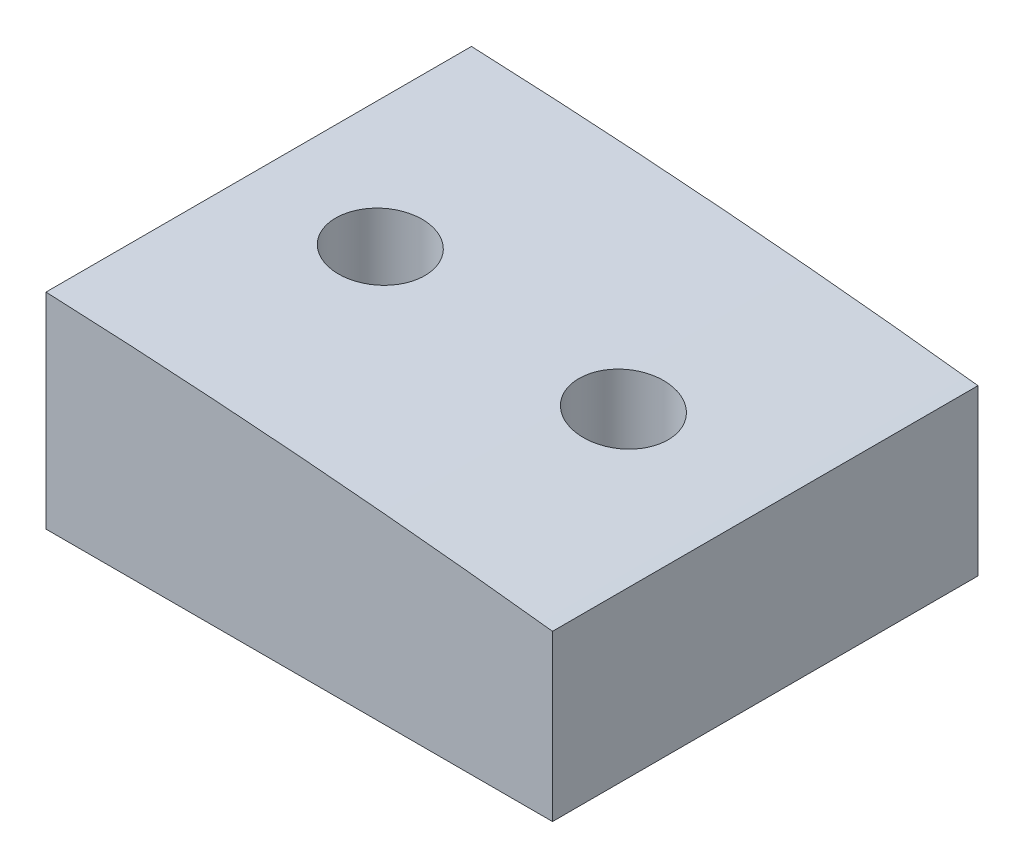
ISO-10303-21;
HEADER;
FILE_DESCRIPTION(('STEP AP214'),'2;1');
FILE_NAME('part.step','',(''),(''),'','','');
FILE_SCHEMA(('AUTOMOTIVE_DESIGN { 1 0 10303 214 1 1 1 1 }'));
ENDSEC;
DATA;
#1=APPLICATION_CONTEXT('core data for automotive mechanical design processes');
#2=APPLICATION_PROTOCOL_DEFINITION('international standard','automotive_design',2000,#1);
#3=PRODUCT_CONTEXT('',#1,'mechanical');
#4=PRODUCT('Part','Part','',(#3));
#5=PRODUCT_RELATED_PRODUCT_CATEGORY('part','',(#4));
#6=PRODUCT_DEFINITION_FORMATION('','',#4);
#7=PRODUCT_DEFINITION_CONTEXT('part definition',#1,'design');
#8=PRODUCT_DEFINITION('design','',#6,#7);
#9=PRODUCT_DEFINITION_SHAPE('','',#8);
#10=(LENGTH_UNIT() NAMED_UNIT(*) SI_UNIT(.MILLI.,.METRE.));
#11=(NAMED_UNIT(*) PLANE_ANGLE_UNIT() SI_UNIT($,.RADIAN.));
#12=(NAMED_UNIT(*) SI_UNIT($,.STERADIAN.) SOLID_ANGLE_UNIT());
#13=UNCERTAINTY_MEASURE_WITH_UNIT(LENGTH_MEASURE(1.E-05),#10,'distance_accuracy_value','');
#14=(GEOMETRIC_REPRESENTATION_CONTEXT(3) GLOBAL_UNCERTAINTY_ASSIGNED_CONTEXT((#13)) GLOBAL_UNIT_ASSIGNED_CONTEXT((#10,
#11,#12)) REPRESENTATION_CONTEXT('',''));
#15=CARTESIAN_POINT('',(0.,0.,0.));
#16=DIRECTION('',(0.,0.,1.));
#17=DIRECTION('',(1.,0.,0.));
#18=AXIS2_PLACEMENT_3D('',#15,#16,#17);
#19=CARTESIAN_POINT('',(0.,0.,15.75));
#20=DIRECTION('',(1.,0.,0.));
#21=DIRECTION('',(0.,0.,-1.));
#22=AXIS2_PLACEMENT_3D('',#19,#20,#21);
#23=PLANE('',#22);
#24=DIRECTION('',(0.,-1.,0.));
#25=VECTOR('',#24,1.);
#26=CARTESIAN_POINT('',(0.,0.,-15.75));
#27=LINE('',#26,#25);
#28=CARTESIAN_POINT('',(0.,15.2,-15.75));
#29=VERTEX_POINT('',#28);
#30=CARTESIAN_POINT('',(0.,0.,-15.75));
#31=VERTEX_POINT('',#30);
#32=EDGE_CURVE('E104',#29,#31,#27,.T.);
#33=ORIENTED_EDGE('',*,*,#32,.T.);
#34=DIRECTION('',(0.,0.,-1.));
#35=VECTOR('',#34,1.);
#36=CARTESIAN_POINT('',(0.,0.,15.75));
#37=LINE('',#36,#35);
#38=CARTESIAN_POINT('',(0.,0.,15.75));
#39=VERTEX_POINT('',#38);
#40=EDGE_CURVE('E11',#39,#31,#37,.T.);
#41=ORIENTED_EDGE('',*,*,#40,.F.);
#42=DIRECTION('',(0.,-1.,0.));
#43=VECTOR('',#42,1.);
#44=CARTESIAN_POINT('',(0.,0.,15.75));
#45=LINE('',#44,#43);
#46=CARTESIAN_POINT('',(0.,15.2,15.75));
#47=VERTEX_POINT('',#46);
#48=EDGE_CURVE('E91',#47,#39,#45,.T.);
#49=ORIENTED_EDGE('',*,*,#48,.F.);
#50=DIRECTION('',(0.,0.,-1.));
#51=VECTOR('',#50,1.);
#52=CARTESIAN_POINT('',(0.,15.2,15.75));
#53=LINE('',#52,#51);
#54=EDGE_CURVE('E100',#47,#29,#53,.T.);
#55=ORIENTED_EDGE('',*,*,#54,.T.);
#56=EDGE_LOOP('',(#33,#41,#49,#55));
#57=FACE_BOUND('',#56,.T.);
#58=ADVANCED_FACE('F34',(#57),#23,.F.);
#59=CARTESIAN_POINT('',(0.,0.,15.75));
#60=DIRECTION('',(0.,1.,0.));
#61=DIRECTION('',(0.,0.,1.));
#62=AXIS2_PLACEMENT_3D('',#59,#60,#61);
#63=PLANE('',#62);
#64=CARTESIAN_POINT('',(9.,0.,0.));
#65=DIRECTION('',(0.,-1.,0.));
#66=DIRECTION('',(0.,0.,-1.));
#67=AXIS2_PLACEMENT_3D('',#64,#65,#66);
#68=CIRCLE('',#67,3.29999999999999);
#69=CARTESIAN_POINT('',(9.,0.,-3.29999999999999));
#70=VERTEX_POINT('',#69);
#71=EDGE_CURVE('E152',#70,#70,#68,.T.);
#72=ORIENTED_EDGE('',*,*,#71,.F.);
#73=EDGE_LOOP('',(#72));
#74=FACE_BOUND('',#73,.T.);
#75=CARTESIAN_POINT('',(27.,0.,0.));
#76=DIRECTION('',(0.,-1.,0.));
#77=DIRECTION('',(0.,0.,-1.));
#78=AXIS2_PLACEMENT_3D('',#75,#76,#77);
#79=CIRCLE('',#78,3.29999999999999);
#80=CARTESIAN_POINT('',(27.,0.,-3.29999999999999));
#81=VERTEX_POINT('',#80);
#82=EDGE_CURVE('E116',#81,#81,#79,.T.);
#83=ORIENTED_EDGE('',*,*,#82,.F.);
#84=EDGE_LOOP('',(#83));
#85=FACE_BOUND('',#84,.T.);
#86=DIRECTION('',(1.,0.,0.));
#87=VECTOR('',#86,1.);
#88=CARTESIAN_POINT('',(0.,0.,-15.75));
#89=LINE('',#88,#87);
#90=CARTESIAN_POINT('',(37.5,0.,-15.75));
#91=VERTEX_POINT('',#90);
#92=EDGE_CURVE('E95',#31,#91,#89,.T.);
#93=ORIENTED_EDGE('',*,*,#92,.T.);
#94=DIRECTION('',(0.,0.,-1.));
#95=VECTOR('',#94,1.);
#96=CARTESIAN_POINT('',(37.5,0.,15.75));
#97=LINE('',#96,#95);
#98=CARTESIAN_POINT('',(37.5,0.,15.75));
#99=VERTEX_POINT('',#98);
#100=EDGE_CURVE('E47',#99,#91,#97,.T.);
#101=ORIENTED_EDGE('',*,*,#100,.F.);
#102=DIRECTION('',(1.,0.,0.));
#103=VECTOR('',#102,1.);
#104=CARTESIAN_POINT('',(0.,0.,15.75));
#105=LINE('',#104,#103);
#106=EDGE_CURVE('E86',#39,#99,#105,.T.);
#107=ORIENTED_EDGE('',*,*,#106,.F.);
#108=ORIENTED_EDGE('',*,*,#40,.T.);
#109=EDGE_LOOP('',(#93,#101,#107,#108));
#110=FACE_BOUND('',#109,.T.);
#111=ADVANCED_FACE('F94',(#74,#85,#110),#63,.F.);
#112=CARTESIAN_POINT('',(37.5,0.,15.75));
#113=DIRECTION('',(-1.,0.,0.));
#114=DIRECTION('',(0.,0.,1.));
#115=AXIS2_PLACEMENT_3D('',#112,#113,#114);
#116=PLANE('',#115);
#117=DIRECTION('',(0.,1.,0.));
#118=VECTOR('',#117,1.);
#119=CARTESIAN_POINT('',(37.5,0.,-15.75));
#120=LINE('',#119,#118);
#121=CARTESIAN_POINT('',(37.5,12.2,-15.75));
#122=VERTEX_POINT('',#121);
#123=EDGE_CURVE('E73',#91,#122,#120,.T.);
#124=ORIENTED_EDGE('',*,*,#123,.T.);
#125=DIRECTION('',(0.,0.,-1.));
#126=VECTOR('',#125,1.);
#127=CARTESIAN_POINT('',(37.5,12.2,15.75));
#128=LINE('',#127,#126);
#129=CARTESIAN_POINT('',(37.5,12.2,15.75));
#130=VERTEX_POINT('',#129);
#131=EDGE_CURVE('E96',#130,#122,#128,.T.);
#132=ORIENTED_EDGE('',*,*,#131,.F.);
#133=DIRECTION('',(0.,1.,0.));
#134=VECTOR('',#133,1.);
#135=CARTESIAN_POINT('',(37.5,0.,15.75));
#136=LINE('',#135,#134);
#137=EDGE_CURVE('E89',#99,#130,#136,.T.);
#138=ORIENTED_EDGE('',*,*,#137,.F.);
#139=ORIENTED_EDGE('',*,*,#100,.T.);
#140=EDGE_LOOP('',(#124,#132,#138,#139));
#141=FACE_BOUND('',#140,.T.);
#142=ADVANCED_FACE('F98',(#141),#116,.F.);
#143=CARTESIAN_POINT('',(-21.0943862951468,-484.354828689335,15.75));
#144=DIRECTION('',(0.,0.,-1.));
#145=DIRECTION('',(-1.,0.,0.));
#146=AXIS2_PLACEMENT_3D('',#143,#144,#145);
#147=CYLINDRICAL_SURFACE('',#146,500.);
#148=CARTESIAN_POINT('',(9.,14.738677493142,-3.29999999999999));
#149=CARTESIAN_POINT('',(9.18565712686344,14.7274825739402,-3.29999180146178));
#150=CARTESIAN_POINT('',(9.37144267998909,14.7161751221343,-3.28428034007193));
#151=CARTESIAN_POINT('',(9.73788864176784,14.6936705934038,-3.2218232679846));
#152=CARTESIAN_POINT('',(9.91854258516704,14.682473666386,-3.17504017445096));
#153=CARTESIAN_POINT('',(10.2693687190537,14.6605475778341,-3.05176029979788));
#154=CARTESIAN_POINT('',(10.4395455952419,14.6498182078293,-2.97527691515493));
#155=CARTESIAN_POINT('',(10.7646006126629,14.6291705644604,-2.79477049174655));
#156=CARTESIAN_POINT('',(10.9194826003314,14.6192520872775,-2.69075440138667));
#157=CARTESIAN_POINT('',(11.2095051398321,14.60055983839,-2.45817366707682));
#158=CARTESIAN_POINT('',(11.3446565256022,14.5917854387653,-2.32962258528048));
#159=CARTESIAN_POINT('',(11.5914552332624,14.5756785950934,-2.05156454882125));
#160=CARTESIAN_POINT('',(11.7031018377179,14.5683461950606,-1.90205695473641));
#161=CARTESIAN_POINT('',(11.8994910050037,14.5553974679215,-1.5866324210156));
#162=CARTESIAN_POINT('',(11.9842837691861,14.5497779394707,-1.42074686985118));
#163=CARTESIAN_POINT('',(12.124811273064,14.5404407829825,-1.07704370679564));
#164=CARTESIAN_POINT('',(12.1805464226494,14.5367231281171,-0.899226263257029));
#165=CARTESIAN_POINT('',(12.2612703897598,14.5313324913458,-0.537087174043717));
#166=CARTESIAN_POINT('',(12.2863202399056,14.529655450732,-0.352779192005526));
#167=CARTESIAN_POINT('',(12.3051548087446,14.5283948688061,0.0174335747184326));
#168=CARTESIAN_POINT('',(12.2989398263974,14.5288113074758,0.203338344118482));
#169=CARTESIAN_POINT('',(12.2554474912469,14.5317205886814,0.571262796422879));
#170=CARTESIAN_POINT('',(12.2182026621125,14.53421125713,0.753286342609667));
#171=CARTESIAN_POINT('',(12.1137636030266,14.5411739972189,1.1084878695712));
#172=CARTESIAN_POINT('',(12.0465693203416,14.545646072348,1.28166583477051));
#173=CARTESIAN_POINT('',(11.8841166208852,14.556410853573,1.61435976509307));
#174=CARTESIAN_POINT('',(11.7888443499851,14.5627044584131,1.7738689355451));
#175=CARTESIAN_POINT('',(11.5729699986133,14.5768855705597,2.07463036823268));
#176=CARTESIAN_POINT('',(11.4523677125113,14.5847730908056,2.21588248224163));
#177=CARTESIAN_POINT('',(11.1890320942293,14.601881151565,2.47638860306202));
#178=CARTESIAN_POINT('',(11.046260399329,14.6111040008729,2.59560367776842));
#179=CARTESIAN_POINT('',(10.7427955301776,14.6305588049166,2.80838144092823));
#180=CARTESIAN_POINT('',(10.5821021489841,14.6407907713045,2.90194383312587));
#181=CARTESIAN_POINT('',(10.2469997945335,14.6619503147049,3.06095666357359));
#182=CARTESIAN_POINT('',(10.0725635403719,14.6728792666715,3.12634942987131));
#183=CARTESIAN_POINT('',(9.71520568755526,14.6950696880821,3.22690809581491));
#184=CARTESIAN_POINT('',(9.53228401783792,14.7063311603105,3.26207374227125));
#185=CARTESIAN_POINT('',(9.16289147437943,14.7288631062692,3.30121286521072));
#186=CARTESIAN_POINT('',(8.9764162938151,14.7401335726565,3.30514571213088));
#187=CARTESIAN_POINT('',(8.60544003252517,14.7623467823866,3.28159520187042));
#188=CARTESIAN_POINT('',(8.42093895569493,14.773289525083,3.2541117827101));
#189=CARTESIAN_POINT('',(8.05914278143961,14.7945523578041,3.16849271035023));
#190=CARTESIAN_POINT('',(7.88184806748726,14.8048724147079,3.1103554282584));
#191=CARTESIAN_POINT('',(7.53952411760083,14.824626615388,2.96506049101552));
#192=CARTESIAN_POINT('',(7.37449482646386,14.8340607631516,2.87790296648536));
#193=CARTESIAN_POINT('',(7.06157572232587,14.8518082601247,2.67713140816705));
#194=CARTESIAN_POINT('',(6.9136683643528,14.8601227581005,2.56354482231594));
#195=CARTESIAN_POINT('',(6.63902352288191,14.8754557865239,2.31307804091055));
#196=CARTESIAN_POINT('',(6.51228588146416,14.8824743266389,2.1761980191339));
#197=CARTESIAN_POINT('',(6.28378864667665,14.8950572897557,1.8832551169204));
#198=CARTESIAN_POINT('',(6.18199098092418,14.9006239300203,1.72722202837092));
#199=CARTESIAN_POINT('',(6.00603803435104,14.9102059359073,1.40023592861763));
#200=CARTESIAN_POINT('',(5.93188250446462,14.9142213155069,1.2292830518637));
#201=CARTESIAN_POINT('',(5.81342498373953,14.9206195661767,0.87756806993478));
#202=CARTESIAN_POINT('',(5.7690813085516,14.9230047167885,0.69682004480297));
#203=CARTESIAN_POINT('',(5.7113517274542,14.9261075157722,0.330431921366309));
#204=CARTESIAN_POINT('',(5.69796570716962,14.9268251703049,0.144791841138042));
#205=CARTESIAN_POINT('',(5.70253329779154,14.9265800414112,-0.22594994964244));
#206=CARTESIAN_POINT('',(5.72046149939033,14.9256186204375,-0.411051974725743));
#207=CARTESIAN_POINT('',(5.78709494928892,14.9220354496559,-0.775614251688947));
#208=CARTESIAN_POINT('',(5.83580021520049,14.9194136988977,-0.955074500340357));
#209=CARTESIAN_POINT('',(5.96259513224089,14.912558349098,-1.3032655390214));
#210=CARTESIAN_POINT('',(6.04068531112987,14.9083247211066,-1.47199613628026));
#211=CARTESIAN_POINT('',(6.22401542639695,14.8983268519584,-1.79394053945912));
#212=CARTESIAN_POINT('',(6.32925437417347,14.8925626665355,-1.94715491010775));
#213=CARTESIAN_POINT('',(6.56396404825693,14.8796146748988,-2.23384759389049));
#214=CARTESIAN_POINT('',(6.6934517485042,14.8724298740672,-2.36731196430367));
#215=CARTESIAN_POINT('',(6.97296433306344,14.8567931492679,-2.61064448604565));
#216=CARTESIAN_POINT('',(7.12299444278303,14.8483409028456,-2.72050661530649));
#217=CARTESIAN_POINT('',(7.43957881764295,14.8303453724748,-2.91368344076168));
#218=CARTESIAN_POINT('',(7.60616353241371,14.8208000729249,-2.99694798393161));
#219=CARTESIAN_POINT('',(7.95076828549686,14.8008671209115,-3.13423607729961));
#220=CARTESIAN_POINT('',(8.12877447447334,14.7904804847599,-3.18829431962404));
#221=CARTESIAN_POINT('',(8.42325469747279,14.773132701313,-3.25128206268707));
#222=CARTESIAN_POINT('',(8.53782978080205,14.7663440618686,-3.26952912375701));
#223=CARTESIAN_POINT('',(8.76825322614375,14.7526107307731,-3.29389065611008));
#224=CARTESIAN_POINT('',(8.88410158913942,14.7456660390014,-3.30000511802355));
#225=CARTESIAN_POINT('',(9.,14.738677493142,-3.29999999999999));
#226=B_SPLINE_CURVE_WITH_KNOTS('',3,(#148,#149,#150,#151,#152,#153,#154,#155,#156,#157,#158,
#159,#160,#161,#162,#163,#164,#165,#166,#167,#168,#169,#170,#171,#172,#173,#174,#175,#176,#177,
#178,#179,#180,#181,#182,#183,#184,#185,#186,#187,#188,#189,#190,#191,#192,#193,#194,#195,#196,
#197,#198,#199,#200,#201,#202,#203,#204,#205,#206,#207,#208,#209,#210,#211,#212,#213,#214,#215,
#216,#217,#218,#219,#220,#221,#222,#223,#224,#225),.UNSPECIFIED.,.T.,.F.,(4,2,2,2,2,2,2,2,2,2,2,
2,2,2,2,2,2,2,2,2,2,2,2,2,2,2,2,2,2,2,2,2,2,2,2,2,2,2,4),(0.,0.557559450648584,1.11579273011289,
1.6737745073697,2.2316156012771,2.78914922700327,3.3466998678162,3.90320196906047,
4.45969622001223,5.01508180519172,5.57046207969082,6.12526096837184,6.68006083391727,
7.2351349062179,7.79021348480761,8.34626352081947,8.90231997822943,9.4595095066531,
10.0167037021831,10.5746226119465,11.1325426224042,11.6904922827368,12.248439431757,
12.8058096902055,13.3631757906485,13.9196856608728,14.4761905166184,15.031915613445,
15.5876386571052,16.1429109797245,16.6981836200911,17.2534662337646,17.8087286301017,
18.3643811686368,18.9201753129491,19.4770113724076,20.0331845428054,20.3812466154969,
20.7293089569873),.UNSPECIFIED.);
#227=CARTESIAN_POINT('',(9.,14.738677493142,-3.29999999999999));
#228=VERTEX_POINT('',#227);
#229=EDGE_CURVE('E37',#228,#228,#226,.T.);
#230=ORIENTED_EDGE('',*,*,#229,.T.);
#231=EDGE_LOOP('',(#230));
#232=FACE_BOUND('',#231,.T.);
#233=CARTESIAN_POINT('',(27.,13.3267261294999,-3.29999999999999));
#234=CARTESIAN_POINT('',(27.1860788002125,13.3087439066153,-3.29999184212326));
#235=CARTESIAN_POINT('',(27.3722824817429,13.2906434532093,-3.28420958259223));
#236=CARTESIAN_POINT('',(27.7395522885618,13.2547377424062,-3.22146667620958));
#237=CARTESIAN_POINT('',(27.9206119161432,13.2369328692215,-3.17446827845345));
#238=CARTESIAN_POINT('',(28.2722325321494,13.2021712088437,-3.05059664038981));
#239=CARTESIAN_POINT('',(28.4427976615484,13.1852140876417,-2.97373527228265));
#240=CARTESIAN_POINT('',(28.7685716255373,13.1526710133111,-2.79229519085668));
#241=CARTESIAN_POINT('',(28.9237844090688,13.1370847076953,-2.68772363076763));
#242=CARTESIAN_POINT('',(29.2141890863854,13.1078016088594,-2.45398576046295));
#243=CARTESIAN_POINT('',(29.3494154790125,13.094101562602,-2.32486273137829));
#244=CARTESIAN_POINT('',(29.5962552758828,13.0690089890321,-2.04553093328607));
#245=CARTESIAN_POINT('',(29.7078682787492,13.0576165009433,-1.89532180593239));
#246=CARTESIAN_POINT('',(29.9037498714066,13.0375715272363,-1.57883168633495));
#247=CARTESIAN_POINT('',(29.9881435878181,13.0289065080452,-1.41262893416066));
#248=CARTESIAN_POINT('',(30.1278216777089,13.0145414677205,-1.06829203818576));
#249=CARTESIAN_POINT('',(30.1831069508009,13.0088413549549,-0.890158263311889));
#250=CARTESIAN_POINT('',(30.2627485881978,13.0006239882817,-0.527920412244978));
#251=CARTESIAN_POINT('',(30.2872499107593,12.9980918171253,-0.343848536125813));
#252=CARTESIAN_POINT('',(30.305083025178,12.996249160934,0.0258132207675462));
#253=CARTESIAN_POINT('',(30.2984154321944,12.9969386123164,0.211403071510366));
#254=CARTESIAN_POINT('',(30.2541619659786,13.0015094362313,0.578362484754185));
#255=CARTESIAN_POINT('',(30.2166505530317,13.0053831216753,0.759741130392171));
#256=CARTESIAN_POINT('',(30.1119020173633,13.0161784939852,1.11360410307374));
#257=CARTESIAN_POINT('',(30.0446648182864,13.0231001886804,1.28608840726949));
#258=CARTESIAN_POINT('',(29.882321841925,13.0397650289583,1.61750060925311));
#259=CARTESIAN_POINT('',(29.787183623573,13.0495114587607,1.7764124467697));
#260=CARTESIAN_POINT('',(29.5718120958838,13.071495522761,2.07601080086547));
#261=CARTESIAN_POINT('',(29.451578307941,13.0837332044704,2.21669696977412));
#262=CARTESIAN_POINT('',(29.1889057032934,13.1103540138597,2.47647985533928));
#263=CARTESIAN_POINT('',(29.0463775715455,13.1247457606381,2.59548537347256));
#264=CARTESIAN_POINT('',(28.7435341418144,13.1551760447772,2.8078996031024));
#265=CARTESIAN_POINT('',(28.5832183582187,13.1712146270964,2.90130761553133));
#266=CARTESIAN_POINT('',(28.2484913362914,13.2045233691425,3.06035499091384));
#267=CARTESIAN_POINT('',(28.074014177648,13.2217992387059,3.12585443608472));
#268=CARTESIAN_POINT('',(27.716595117408,13.2569882137358,3.22660322631186));
#269=CARTESIAN_POINT('',(27.5336530316733,13.2749013330624,3.26185191299563));
#270=CARTESIAN_POINT('',(27.1638225687308,13.3109024011255,3.30119068809881));
#271=CARTESIAN_POINT('',(26.9769228074209,13.3289907387927,3.3051734806222));
#272=CARTESIAN_POINT('',(26.6050859289295,13.3647663050936,3.28157710699831));
#273=CARTESIAN_POINT('',(26.4201488256748,13.3824535308822,3.25399771704129));
#274=CARTESIAN_POINT('',(26.0574031971281,13.4169483080282,3.1680075900431));
#275=CARTESIAN_POINT('',(25.879598168872,13.4337554290525,3.10958192241458));
#276=CARTESIAN_POINT('',(25.5362955152428,13.466031930355,2.96350580527589));
#277=CARTESIAN_POINT('',(25.3707977718282,13.4815013234638,2.87585563610777));
#278=CARTESIAN_POINT('',(25.0572489112368,13.5106665385549,2.6740227139519));
#279=CARTESIAN_POINT('',(24.9091569870682,13.5243665166114,2.55990396333883));
#280=CARTESIAN_POINT('',(24.6342394708665,13.549692160434,2.30822554078634));
#281=CARTESIAN_POINT('',(24.5074134529516,13.5613178677407,2.17066633838838));
#282=CARTESIAN_POINT('',(24.2791767736756,13.5821682241539,1.87659929226596));
#283=CARTESIAN_POINT('',(24.1776664373133,13.5914022955294,1.72016947921468));
#284=CARTESIAN_POINT('',(24.0023570229585,13.6073099564671,1.39236535225531));
#285=CARTESIAN_POINT('',(23.9285572975753,13.6139836058473,1.22099138759612));
#286=CARTESIAN_POINT('',(23.8110570029886,13.6245932280177,0.86888215167319));
#287=CARTESIAN_POINT('',(23.767240333526,13.628539761326,0.688185936698821));
#288=CARTESIAN_POINT('',(23.710521477588,13.6336461409755,0.321967025715951));
#289=CARTESIAN_POINT('',(23.6976188556246,13.6348060265724,0.136444397734608));
#290=CARTESIAN_POINT('',(23.7030977247954,13.6343131909964,-0.233699376333485));
#291=CARTESIAN_POINT('',(23.7214062649512,13.632667028502,-0.418321615838777));
#292=CARTESIAN_POINT('',(23.7886346668758,13.626612283511,-0.78185807630719));
#293=CARTESIAN_POINT('',(23.8375544724296,13.6222037060873,-0.960772307751973));
#294=CARTESIAN_POINT('',(23.9645880346431,13.6107252122319,-1.3078313371017));
#295=CARTESIAN_POINT('',(24.0427027988953,13.6036552039473,-1.47597576307856));
#296=CARTESIAN_POINT('',(24.2258664707614,13.5870184263104,-1.79674509017013));
#297=CARTESIAN_POINT('',(24.3309145585728,13.5774517329525,-1.94937046345976));
#298=CARTESIAN_POINT('',(24.5651936100337,13.5560233630818,-2.23515918185759));
#299=CARTESIAN_POINT('',(24.6944783566675,13.5441565804707,-2.36827804689104));
#300=CARTESIAN_POINT('',(24.973417451022,13.5184252958012,-2.61096619970916));
#301=CARTESIAN_POINT('',(25.1230772204771,13.5045602619562,-2.72052919926368));
#302=CARTESIAN_POINT('',(25.4391585290399,13.4751166661538,-2.91345498027815));
#303=CARTESIAN_POINT('',(25.6056503515866,13.4595308919299,-2.99670136329355));
#304=CARTESIAN_POINT('',(25.949999631956,13.4271070401968,-3.13397177477224));
#305=CARTESIAN_POINT('',(26.1278435536655,13.410270450359,-3.188029905138));
#306=CARTESIAN_POINT('',(26.4223301183056,13.3822251333417,-3.25112502865872));
#307=CARTESIAN_POINT('',(26.5370927846314,13.3712562576277,-3.26943152508762));
#308=CARTESIAN_POINT('',(26.7678874326032,13.349115634838,-3.29387156874904));
#309=CARTESIAN_POINT('',(26.883919417053,13.337943887314,-3.30000508908636));
#310=CARTESIAN_POINT('',(27.,13.3267261294999,-3.29999999999999));
#311=B_SPLINE_CURVE_WITH_KNOTS('',3,(#233,#234,#235,#236,#237,#238,#239,#240,#241,#242,#243,
#244,#245,#246,#247,#248,#249,#250,#251,#252,#253,#254,#255,#256,#257,#258,#259,#260,#261,#262,
#263,#264,#265,#266,#267,#268,#269,#270,#271,#272,#273,#274,#275,#276,#277,#278,#279,#280,#281,
#282,#283,#284,#285,#286,#287,#288,#289,#290,#291,#292,#293,#294,#295,#296,#297,#298,#299,#300,
#301,#302,#303,#304,#305,#306,#307,#308,#309,#310),.UNSPECIFIED.,.T.,.F.,(4,2,2,2,2,2,2,2,2,2,2,
2,2,2,2,2,2,2,2,2,2,2,2,2,2,2,2,2,2,2,2,2,2,2,2,2,2,2,4),(0.,0.560412044625377,1.12150305458077,
1.68237122736011,2.24309475599176,2.8028388140853,3.36259238585927,3.91973483744514,
4.47686006922185,5.03135190510051,5.58583279740625,6.13897902992996,6.69212668330796,
7.24592005973536,7.79972399869897,8.35580624820605,8.91190368280057,9.47075717648001,
10.0296228326457,10.590405526277,11.1511921964838,11.7122505546098,12.2733035308226,
12.8330137412008,13.3927127412035,13.9501719636598,14.5076181616317,15.0628934151157,
15.6181608463612,16.1721322096895,16.7261025556971,17.2800920223998,17.8340646286497,
18.3892814144335,18.9446462316215,19.5024341316234,20.0595689258652,20.4091671231209,
20.758766092785),.UNSPECIFIED.);
#312=CARTESIAN_POINT('',(27.,13.3267261294999,-3.29999999999999));
#313=VERTEX_POINT('',#312);
#314=EDGE_CURVE('E107',#313,#313,#311,.T.);
#315=ORIENTED_EDGE('',*,*,#314,.T.);
#316=EDGE_LOOP('',(#315));
#317=FACE_BOUND('',#316,.T.);
#318=CARTESIAN_POINT('',(-21.0943862951468,-484.354828689335,-15.75));
#319=DIRECTION('',(0.,0.,1.));
#320=DIRECTION('',(-1.,0.,0.));
#321=AXIS2_PLACEMENT_3D('',#318,#319,#320);
#322=CIRCLE('',#321,500.);
#323=EDGE_CURVE('E79',#122,#29,#322,.T.);
#324=ORIENTED_EDGE('',*,*,#323,.T.);
#325=ORIENTED_EDGE('',*,*,#54,.F.);
#326=CARTESIAN_POINT('',(-21.0943862951468,-484.354828689335,15.75));
#327=DIRECTION('',(0.,0.,1.));
#328=DIRECTION('',(-1.,0.,0.));
#329=AXIS2_PLACEMENT_3D('',#326,#327,#328);
#330=CIRCLE('',#329,500.);
#331=EDGE_CURVE('E56',#130,#47,#330,.T.);
#332=ORIENTED_EDGE('',*,*,#331,.F.);
#333=ORIENTED_EDGE('',*,*,#131,.T.);
#334=EDGE_LOOP('',(#324,#325,#332,#333));
#335=FACE_BOUND('',#334,.T.);
#336=ADVANCED_FACE('F117',(#232,#317,#335),#147,.T.);
#337=CARTESIAN_POINT('',(-21.0943862951468,-484.354828689335,15.75));
#338=DIRECTION('',(0.,0.,-1.));
#339=DIRECTION('',(-1.,0.,0.));
#340=AXIS2_PLACEMENT_3D('',#337,#338,#339);
#341=PLANE('',#340);
#342=ORIENTED_EDGE('',*,*,#48,.T.);
#343=ORIENTED_EDGE('',*,*,#106,.T.);
#344=ORIENTED_EDGE('',*,*,#137,.T.);
#345=ORIENTED_EDGE('',*,*,#331,.T.);
#346=EDGE_LOOP('',(#342,#343,#344,#345));
#347=FACE_BOUND('',#346,.T.);
#348=ADVANCED_FACE('F87',(#347),#341,.F.);
#349=CARTESIAN_POINT('',(-21.0943862951468,-484.354828689335,-15.75));
#350=DIRECTION('',(0.,0.,-1.));
#351=DIRECTION('',(-1.,0.,0.));
#352=AXIS2_PLACEMENT_3D('',#349,#350,#351);
#353=PLANE('',#352);
#354=ORIENTED_EDGE('',*,*,#32,.F.);
#355=ORIENTED_EDGE('',*,*,#323,.F.);
#356=ORIENTED_EDGE('',*,*,#123,.F.);
#357=ORIENTED_EDGE('',*,*,#92,.F.);
#358=EDGE_LOOP('',(#354,#355,#356,#357));
#359=FACE_BOUND('',#358,.T.);
#360=ADVANCED_FACE('F126',(#359),#353,.T.);
#361=CARTESIAN_POINT('',(27.,0.,0.));
#362=DIRECTION('',(0.,-1.,0.));
#363=DIRECTION('',(0.,0.,-1.));
#364=AXIS2_PLACEMENT_3D('',#361,#362,#363);
#365=CYLINDRICAL_SURFACE('',#364,3.29999999999999);
#366=ORIENTED_EDGE('',*,*,#82,.T.);
#367=EDGE_LOOP('',(#366));
#368=FACE_BOUND('',#367,.T.);
#369=ORIENTED_EDGE('',*,*,#314,.F.);
#370=EDGE_LOOP('',(#369));
#371=FACE_BOUND('',#370,.T.);
#372=ADVANCED_FACE('F121',(#368,#371),#365,.F.);
#373=CARTESIAN_POINT('',(9.,0.,0.));
#374=DIRECTION('',(0.,-1.,0.));
#375=DIRECTION('',(0.,0.,-1.));
#376=AXIS2_PLACEMENT_3D('',#373,#374,#375);
#377=CYLINDRICAL_SURFACE('',#376,3.29999999999999);
#378=ORIENTED_EDGE('',*,*,#71,.T.);
#379=EDGE_LOOP('',(#378));
#380=FACE_BOUND('',#379,.T.);
#381=ORIENTED_EDGE('',*,*,#229,.F.);
#382=EDGE_LOOP('',(#381));
#383=FACE_BOUND('',#382,.T.);
#384=ADVANCED_FACE('F125',(#380,#383),#377,.F.);
#385=CLOSED_SHELL('',(#58,#111,#142,#336,#348,#360,#372,#384));
#386=MANIFOLD_SOLID_BREP('B2',#385);
#387=ADVANCED_BREP_SHAPE_REPRESENTATION('',(#18,#386),#14);
#388=SHAPE_DEFINITION_REPRESENTATION(#9,#387);
ENDSEC;
END-ISO-10303-21;
